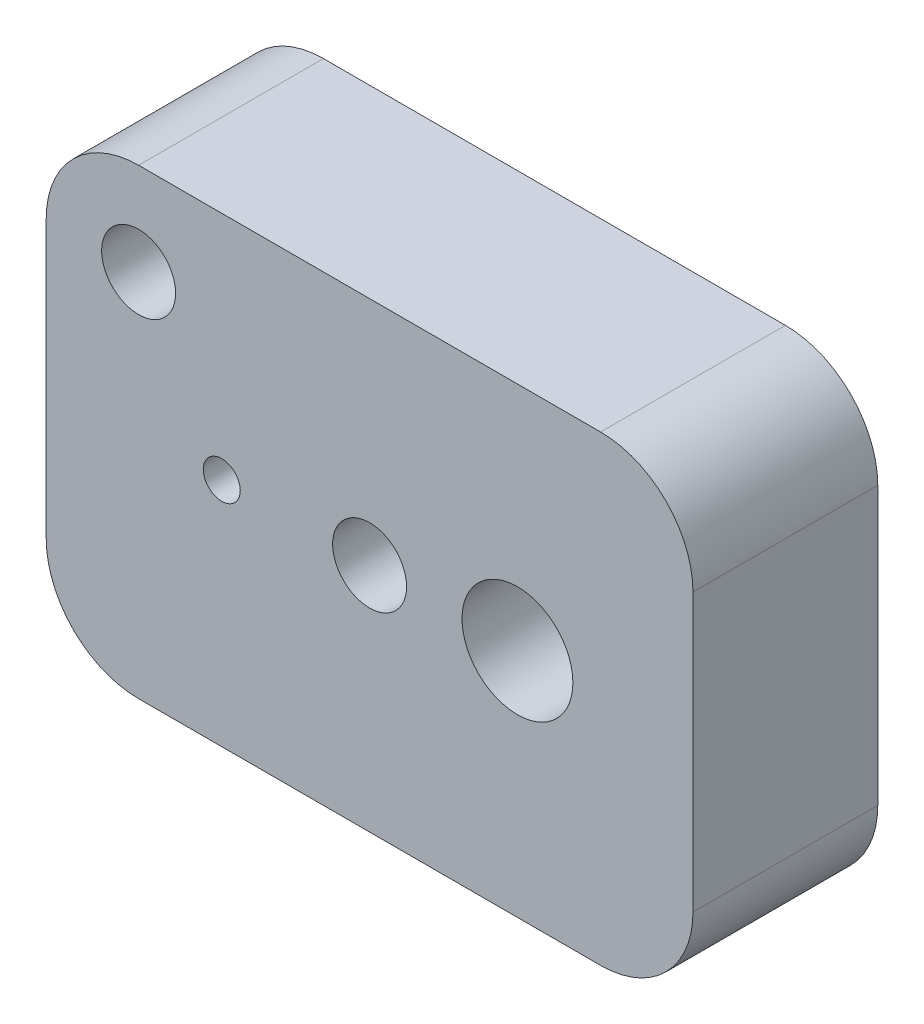
ISO-10303-21;
HEADER;
FILE_DESCRIPTION(('STEP AP214'),'2;1');
FILE_NAME('part.step','',(''),(''),'','','');
FILE_SCHEMA(('AUTOMOTIVE_DESIGN { 1 0 10303 214 1 1 1 1 }'));
ENDSEC;
DATA;
#1=APPLICATION_CONTEXT('core data for automotive mechanical design processes');
#2=APPLICATION_PROTOCOL_DEFINITION('international standard','automotive_design',2000,#1);
#3=PRODUCT_CONTEXT('',#1,'mechanical');
#4=PRODUCT('Part','Part','',(#3));
#5=PRODUCT_RELATED_PRODUCT_CATEGORY('part','',(#4));
#6=PRODUCT_DEFINITION_FORMATION('','',#4);
#7=PRODUCT_DEFINITION_CONTEXT('part definition',#1,'design');
#8=PRODUCT_DEFINITION('design','',#6,#7);
#9=PRODUCT_DEFINITION_SHAPE('','',#8);
#10=(LENGTH_UNIT() NAMED_UNIT(*) SI_UNIT(.MILLI.,.METRE.));
#11=(NAMED_UNIT(*) PLANE_ANGLE_UNIT() SI_UNIT($,.RADIAN.));
#12=(NAMED_UNIT(*) SI_UNIT($,.STERADIAN.) SOLID_ANGLE_UNIT());
#13=UNCERTAINTY_MEASURE_WITH_UNIT(LENGTH_MEASURE(1.E-05),#10,'distance_accuracy_value','');
#14=(GEOMETRIC_REPRESENTATION_CONTEXT(3) GLOBAL_UNCERTAINTY_ASSIGNED_CONTEXT((#13)) GLOBAL_UNIT_ASSIGNED_CONTEXT((#10,
#11,#12)) REPRESENTATION_CONTEXT('',''));
#15=CARTESIAN_POINT('',(0.,0.,0.));
#16=DIRECTION('',(0.,0.,1.));
#17=DIRECTION('',(1.,0.,0.));
#18=AXIS2_PLACEMENT_3D('',#15,#16,#17);
#19=CARTESIAN_POINT('',(17.5,12.5,0.));
#20=DIRECTION('',(0.,0.,1.));
#21=DIRECTION('',(1.,0.,0.));
#22=AXIS2_PLACEMENT_3D('',#19,#20,#21);
#23=PLANE('',#22);
#24=CARTESIAN_POINT('',(5.,20.,0.));
#25=DIRECTION('',(0.,0.,1.));
#26=DIRECTION('',(1.,0.,0.));
#27=AXIS2_PLACEMENT_3D('',#24,#25,#26);
#28=CIRCLE('',#27,2.);
#29=CARTESIAN_POINT('',(7.,20.,0.));
#30=VERTEX_POINT('',#29);
#31=EDGE_CURVE('E63',#30,#30,#28,.T.);
#32=ORIENTED_EDGE('',*,*,#31,.T.);
#33=EDGE_LOOP('',(#32));
#34=FACE_BOUND('',#33,.T.);
#35=ADVANCED_FACE('F52',(#34),#23,.T.);
#36=CARTESIAN_POINT('',(17.5,12.5,7.));
#37=DIRECTION('',(0.,0.,1.));
#38=DIRECTION('',(1.,0.,0.));
#39=AXIS2_PLACEMENT_3D('',#36,#37,#38);
#40=PLANE('',#39);
#41=CARTESIAN_POINT('',(5.,20.,7.));
#42=DIRECTION('',(0.,0.,1.));
#43=DIRECTION('',(1.,0.,0.));
#44=AXIS2_PLACEMENT_3D('',#41,#42,#43);
#45=CIRCLE('',#44,2.);
#46=CARTESIAN_POINT('',(7.,20.,7.));
#47=VERTEX_POINT('',#46);
#48=EDGE_CURVE('E12',#47,#47,#45,.T.);
#49=ORIENTED_EDGE('',*,*,#48,.F.);
#50=EDGE_LOOP('',(#49));
#51=FACE_BOUND('',#50,.T.);
#52=DIRECTION('',(1.,0.,0.));
#53=VECTOR('',#52,1.);
#54=CARTESIAN_POINT('',(17.5,25.,7.));
#55=LINE('',#54,#53);
#56=CARTESIAN_POINT('',(5.,25.,7.));
#57=VERTEX_POINT('',#56);
#58=CARTESIAN_POINT('',(30.,25.,7.));
#59=VERTEX_POINT('',#58);
#60=EDGE_CURVE('E194',#57,#59,#55,.T.);
#61=ORIENTED_EDGE('',*,*,#60,.F.);
#62=CARTESIAN_POINT('',(5.,20.,7.));
#63=DIRECTION('',(0.,0.,1.));
#64=DIRECTION('',(1.,0.,0.));
#65=AXIS2_PLACEMENT_3D('',#62,#63,#64);
#66=CIRCLE('',#65,5.);
#67=CARTESIAN_POINT('',(0.,20.,7.));
#68=VERTEX_POINT('',#67);
#69=EDGE_CURVE('E217',#57,#68,#66,.T.);
#70=ORIENTED_EDGE('',*,*,#69,.T.);
#71=DIRECTION('',(0.,1.,0.));
#72=VECTOR('',#71,1.);
#73=CARTESIAN_POINT('',(0.,12.5,7.));
#74=LINE('',#73,#72);
#75=CARTESIAN_POINT('',(0.,5.,7.));
#76=VERTEX_POINT('',#75);
#77=EDGE_CURVE('E203',#76,#68,#74,.T.);
#78=ORIENTED_EDGE('',*,*,#77,.F.);
#79=CARTESIAN_POINT('',(5.,5.,7.));
#80=DIRECTION('',(0.,0.,1.));
#81=DIRECTION('',(1.,0.,0.));
#82=AXIS2_PLACEMENT_3D('',#79,#80,#81);
#83=CIRCLE('',#82,5.);
#84=CARTESIAN_POINT('',(5.,0.,7.));
#85=VERTEX_POINT('',#84);
#86=EDGE_CURVE('E153',#76,#85,#83,.T.);
#87=ORIENTED_EDGE('',*,*,#86,.T.);
#88=DIRECTION('',(1.,0.,0.));
#89=VECTOR('',#88,1.);
#90=CARTESIAN_POINT('',(17.5,0.,7.));
#91=LINE('',#90,#89);
#92=CARTESIAN_POINT('',(30.,0.,7.));
#93=VERTEX_POINT('',#92);
#94=EDGE_CURVE('E148',#85,#93,#91,.T.);
#95=ORIENTED_EDGE('',*,*,#94,.T.);
#96=CARTESIAN_POINT('',(30.,5.,7.));
#97=DIRECTION('',(0.,0.,1.));
#98=DIRECTION('',(1.,0.,0.));
#99=AXIS2_PLACEMENT_3D('',#96,#97,#98);
#100=CIRCLE('',#99,5.);
#101=CARTESIAN_POINT('',(35.,5.,7.));
#102=VERTEX_POINT('',#101);
#103=EDGE_CURVE('E135',#93,#102,#100,.T.);
#104=ORIENTED_EDGE('',*,*,#103,.T.);
#105=DIRECTION('',(0.,1.,0.));
#106=VECTOR('',#105,1.);
#107=CARTESIAN_POINT('',(35.,12.5,7.));
#108=LINE('',#107,#106);
#109=CARTESIAN_POINT('',(35.,20.,7.));
#110=VERTEX_POINT('',#109);
#111=EDGE_CURVE('E186',#102,#110,#108,.T.);
#112=ORIENTED_EDGE('',*,*,#111,.T.);
#113=CARTESIAN_POINT('',(30.,20.,7.));
#114=DIRECTION('',(0.,0.,1.));
#115=DIRECTION('',(1.,0.,0.));
#116=AXIS2_PLACEMENT_3D('',#113,#114,#115);
#117=CIRCLE('',#116,5.);
#118=EDGE_CURVE('E75',#110,#59,#117,.T.);
#119=ORIENTED_EDGE('',*,*,#118,.T.);
#120=EDGE_LOOP('',(#61,#70,#78,#87,#95,#104,#112,#119));
#121=FACE_BOUND('',#120,.T.);
#122=CARTESIAN_POINT('',(17.5,12.5,7.));
#123=DIRECTION('',(0.,0.,1.));
#124=DIRECTION('',(1.,0.,0.));
#125=AXIS2_PLACEMENT_3D('',#122,#123,#124);
#126=CIRCLE('',#125,2.);
#127=CARTESIAN_POINT('',(19.5,12.5,7.));
#128=VERTEX_POINT('',#127);
#129=EDGE_CURVE('E218',#128,#128,#126,.T.);
#130=ORIENTED_EDGE('',*,*,#129,.F.);
#131=EDGE_LOOP('',(#130));
#132=FACE_BOUND('',#131,.T.);
#133=CARTESIAN_POINT('',(9.49999999999999,12.5,7.));
#134=DIRECTION('',(0.,0.,1.));
#135=DIRECTION('',(1.,0.,0.));
#136=AXIS2_PLACEMENT_3D('',#133,#134,#135);
#137=CIRCLE('',#136,1.);
#138=CARTESIAN_POINT('',(10.5,12.5,7.));
#139=VERTEX_POINT('',#138);
#140=EDGE_CURVE('E221',#139,#139,#137,.T.);
#141=ORIENTED_EDGE('',*,*,#140,.F.);
#142=EDGE_LOOP('',(#141));
#143=FACE_BOUND('',#142,.T.);
#144=CARTESIAN_POINT('',(25.5,12.5,7.));
#145=DIRECTION('',(0.,0.,1.));
#146=DIRECTION('',(1.,0.,0.));
#147=AXIS2_PLACEMENT_3D('',#144,#145,#146);
#148=CIRCLE('',#147,3.);
#149=CARTESIAN_POINT('',(28.5,12.5,7.));
#150=VERTEX_POINT('',#149);
#151=EDGE_CURVE('E56',#150,#150,#148,.T.);
#152=ORIENTED_EDGE('',*,*,#151,.F.);
#153=EDGE_LOOP('',(#152));
#154=FACE_BOUND('',#153,.T.);
#155=ADVANCED_FACE('F150',(#51,#121,#132,#143,#154),#40,.T.);
#156=CARTESIAN_POINT('',(5.,20.,7.));
#157=DIRECTION('',(0.,0.,-1.));
#158=DIRECTION('',(-1.,0.,0.));
#159=AXIS2_PLACEMENT_3D('',#156,#157,#158);
#160=CYLINDRICAL_SURFACE('',#159,2.);
#161=ORIENTED_EDGE('',*,*,#31,.F.);
#162=EDGE_LOOP('',(#161));
#163=FACE_BOUND('',#162,.T.);
#164=ORIENTED_EDGE('',*,*,#48,.T.);
#165=EDGE_LOOP('',(#164));
#166=FACE_BOUND('',#165,.T.);
#167=ADVANCED_FACE('F298',(#163,#166),#160,.F.);
#168=CARTESIAN_POINT('',(17.5,12.5,-3.));
#169=DIRECTION('',(0.,0.,1.));
#170=DIRECTION('',(1.,0.,0.));
#171=AXIS2_PLACEMENT_3D('',#168,#169,#170);
#172=PLANE('',#171);
#173=CARTESIAN_POINT('',(9.49999999999999,12.5,-3.));
#174=DIRECTION('',(0.,0.,1.));
#175=DIRECTION('',(1.,0.,0.));
#176=AXIS2_PLACEMENT_3D('',#173,#174,#175);
#177=CIRCLE('',#176,1.);
#178=CARTESIAN_POINT('',(10.5,12.5,-3.));
#179=VERTEX_POINT('',#178);
#180=EDGE_CURVE('E195',#179,#179,#177,.T.);
#181=ORIENTED_EDGE('',*,*,#180,.T.);
#182=EDGE_LOOP('',(#181));
#183=FACE_BOUND('',#182,.T.);
#184=CARTESIAN_POINT('',(17.5,12.5,-3.));
#185=DIRECTION('',(0.,0.,1.));
#186=DIRECTION('',(1.,0.,0.));
#187=AXIS2_PLACEMENT_3D('',#184,#185,#186);
#188=CIRCLE('',#187,2.);
#189=CARTESIAN_POINT('',(19.5,12.5,-3.));
#190=VERTEX_POINT('',#189);
#191=EDGE_CURVE('E222',#190,#190,#188,.T.);
#192=ORIENTED_EDGE('',*,*,#191,.T.);
#193=EDGE_LOOP('',(#192));
#194=FACE_BOUND('',#193,.T.);
#195=CARTESIAN_POINT('',(25.5,12.5,-3.));
#196=DIRECTION('',(0.,0.,1.));
#197=DIRECTION('',(1.,0.,0.));
#198=AXIS2_PLACEMENT_3D('',#195,#196,#197);
#199=CIRCLE('',#198,3.);
#200=CARTESIAN_POINT('',(28.5,12.5,-3.));
#201=VERTEX_POINT('',#200);
#202=EDGE_CURVE('E236',#201,#201,#199,.T.);
#203=ORIENTED_EDGE('',*,*,#202,.T.);
#204=EDGE_LOOP('',(#203));
#205=FACE_BOUND('',#204,.T.);
#206=DIRECTION('',(1.,0.,0.));
#207=VECTOR('',#206,1.);
#208=CARTESIAN_POINT('',(17.5,25.,-3.));
#209=LINE('',#208,#207);
#210=CARTESIAN_POINT('',(5.,25.,-3.));
#211=VERTEX_POINT('',#210);
#212=CARTESIAN_POINT('',(30.,25.,-3.));
#213=VERTEX_POINT('',#212);
#214=EDGE_CURVE('E199',#211,#213,#209,.T.);
#215=ORIENTED_EDGE('',*,*,#214,.T.);
#216=CARTESIAN_POINT('',(30.,20.,-3.));
#217=DIRECTION('',(0.,0.,1.));
#218=DIRECTION('',(1.,0.,0.));
#219=AXIS2_PLACEMENT_3D('',#216,#217,#218);
#220=CIRCLE('',#219,5.);
#221=CARTESIAN_POINT('',(35.,20.,-3.));
#222=VERTEX_POINT('',#221);
#223=EDGE_CURVE('E177',#222,#213,#220,.T.);
#224=ORIENTED_EDGE('',*,*,#223,.F.);
#225=DIRECTION('',(0.,1.,0.));
#226=VECTOR('',#225,1.);
#227=CARTESIAN_POINT('',(35.,12.5,-3.));
#228=LINE('',#227,#226);
#229=CARTESIAN_POINT('',(35.,5.,-3.));
#230=VERTEX_POINT('',#229);
#231=EDGE_CURVE('E210',#230,#222,#228,.T.);
#232=ORIENTED_EDGE('',*,*,#231,.F.);
#233=CARTESIAN_POINT('',(30.,5.,-3.));
#234=DIRECTION('',(0.,0.,1.));
#235=DIRECTION('',(1.,0.,0.));
#236=AXIS2_PLACEMENT_3D('',#233,#234,#235);
#237=CIRCLE('',#236,5.);
#238=CARTESIAN_POINT('',(30.,0.,-3.));
#239=VERTEX_POINT('',#238);
#240=EDGE_CURVE('E145',#239,#230,#237,.T.);
#241=ORIENTED_EDGE('',*,*,#240,.F.);
#242=DIRECTION('',(1.,0.,0.));
#243=VECTOR('',#242,1.);
#244=CARTESIAN_POINT('',(17.5,0.,-3.));
#245=LINE('',#244,#243);
#246=CARTESIAN_POINT('',(5.,0.,-3.));
#247=VERTEX_POINT('',#246);
#248=EDGE_CURVE('E158',#247,#239,#245,.T.);
#249=ORIENTED_EDGE('',*,*,#248,.F.);
#250=CARTESIAN_POINT('',(5.,5.,-3.));
#251=DIRECTION('',(0.,0.,1.));
#252=DIRECTION('',(1.,0.,0.));
#253=AXIS2_PLACEMENT_3D('',#250,#251,#252);
#254=CIRCLE('',#253,5.);
#255=CARTESIAN_POINT('',(0.,5.,-3.));
#256=VERTEX_POINT('',#255);
#257=EDGE_CURVE('E162',#256,#247,#254,.T.);
#258=ORIENTED_EDGE('',*,*,#257,.F.);
#259=DIRECTION('',(0.,1.,0.));
#260=VECTOR('',#259,1.);
#261=CARTESIAN_POINT('',(0.,12.5,-3.));
#262=LINE('',#261,#260);
#263=CARTESIAN_POINT('',(0.,20.,-3.));
#264=VERTEX_POINT('',#263);
#265=EDGE_CURVE('E183',#256,#264,#262,.T.);
#266=ORIENTED_EDGE('',*,*,#265,.T.);
#267=CARTESIAN_POINT('',(5.,20.,-3.));
#268=DIRECTION('',(0.,0.,1.));
#269=DIRECTION('',(1.,0.,0.));
#270=AXIS2_PLACEMENT_3D('',#267,#268,#269);
#271=CIRCLE('',#270,5.);
#272=EDGE_CURVE('E170',#211,#264,#271,.T.);
#273=ORIENTED_EDGE('',*,*,#272,.F.);
#274=EDGE_LOOP('',(#215,#224,#232,#241,#249,#258,#266,#273));
#275=FACE_BOUND('',#274,.T.);
#276=ADVANCED_FACE('F323',(#183,#194,#205,#275),#172,.F.);
#277=CARTESIAN_POINT('',(30.,20.,-3.));
#278=DIRECTION('',(0.,0.,1.));
#279=DIRECTION('',(1.,0.,0.));
#280=AXIS2_PLACEMENT_3D('',#277,#278,#279);
#281=CYLINDRICAL_SURFACE('',#280,5.);
#282=DIRECTION('',(0.,0.,1.));
#283=VECTOR('',#282,1.);
#284=CARTESIAN_POINT('',(30.,25.,-3.));
#285=LINE('',#284,#283);
#286=EDGE_CURVE('E196',#213,#59,#285,.T.);
#287=ORIENTED_EDGE('',*,*,#286,.T.);
#288=ORIENTED_EDGE('',*,*,#118,.F.);
#289=DIRECTION('',(0.,0.,1.));
#290=VECTOR('',#289,1.);
#291=CARTESIAN_POINT('',(35.,20.,-3.));
#292=LINE('',#291,#290);
#293=EDGE_CURVE('E174',#222,#110,#292,.T.);
#294=ORIENTED_EDGE('',*,*,#293,.F.);
#295=ORIENTED_EDGE('',*,*,#223,.T.);
#296=EDGE_LOOP('',(#287,#288,#294,#295));
#297=FACE_BOUND('',#296,.T.);
#298=ADVANCED_FACE('F316',(#297),#281,.T.);
#299=CARTESIAN_POINT('',(35.,12.5,-3.));
#300=DIRECTION('',(1.,0.,0.));
#301=DIRECTION('',(0.,1.,0.));
#302=AXIS2_PLACEMENT_3D('',#299,#300,#301);
#303=PLANE('',#302);
#304=ORIENTED_EDGE('',*,*,#293,.T.);
#305=ORIENTED_EDGE('',*,*,#111,.F.);
#306=DIRECTION('',(0.,0.,1.));
#307=VECTOR('',#306,1.);
#308=CARTESIAN_POINT('',(35.,5.,-3.));
#309=LINE('',#308,#307);
#310=EDGE_CURVE('E142',#230,#102,#309,.T.);
#311=ORIENTED_EDGE('',*,*,#310,.F.);
#312=ORIENTED_EDGE('',*,*,#231,.T.);
#313=EDGE_LOOP('',(#304,#305,#311,#312));
#314=FACE_BOUND('',#313,.T.);
#315=ADVANCED_FACE('F307',(#314),#303,.T.);
#316=CARTESIAN_POINT('',(30.,5.,-3.));
#317=DIRECTION('',(0.,0.,1.));
#318=DIRECTION('',(1.,0.,0.));
#319=AXIS2_PLACEMENT_3D('',#316,#317,#318);
#320=CYLINDRICAL_SURFACE('',#319,5.);
#321=ORIENTED_EDGE('',*,*,#310,.T.);
#322=ORIENTED_EDGE('',*,*,#103,.F.);
#323=DIRECTION('',(0.,0.,1.));
#324=VECTOR('',#323,1.);
#325=CARTESIAN_POINT('',(30.,0.,-3.));
#326=LINE('',#325,#324);
#327=EDGE_CURVE('E140',#239,#93,#326,.T.);
#328=ORIENTED_EDGE('',*,*,#327,.F.);
#329=ORIENTED_EDGE('',*,*,#240,.T.);
#330=EDGE_LOOP('',(#321,#322,#328,#329));
#331=FACE_BOUND('',#330,.T.);
#332=ADVANCED_FACE('F137',(#331),#320,.T.);
#333=CARTESIAN_POINT('',(17.5,0.,-3.));
#334=DIRECTION('',(0.,-1.,0.));
#335=DIRECTION('',(0.,0.,-1.));
#336=AXIS2_PLACEMENT_3D('',#333,#334,#335);
#337=PLANE('',#336);
#338=ORIENTED_EDGE('',*,*,#327,.T.);
#339=ORIENTED_EDGE('',*,*,#94,.F.);
#340=DIRECTION('',(0.,0.,1.));
#341=VECTOR('',#340,1.);
#342=CARTESIAN_POINT('',(5.,0.,-3.));
#343=LINE('',#342,#341);
#344=EDGE_CURVE('E180',#247,#85,#343,.T.);
#345=ORIENTED_EDGE('',*,*,#344,.F.);
#346=ORIENTED_EDGE('',*,*,#248,.T.);
#347=EDGE_LOOP('',(#338,#339,#345,#346));
#348=FACE_BOUND('',#347,.T.);
#349=ADVANCED_FACE('F54',(#348),#337,.T.);
#350=CARTESIAN_POINT('',(5.,5.,-3.));
#351=DIRECTION('',(0.,0.,1.));
#352=DIRECTION('',(1.,0.,0.));
#353=AXIS2_PLACEMENT_3D('',#350,#351,#352);
#354=CYLINDRICAL_SURFACE('',#353,5.);
#355=ORIENTED_EDGE('',*,*,#344,.T.);
#356=ORIENTED_EDGE('',*,*,#86,.F.);
#357=DIRECTION('',(0.,0.,1.));
#358=VECTOR('',#357,1.);
#359=CARTESIAN_POINT('',(0.,5.,-3.));
#360=LINE('',#359,#358);
#361=EDGE_CURVE('E207',#256,#76,#360,.T.);
#362=ORIENTED_EDGE('',*,*,#361,.F.);
#363=ORIENTED_EDGE('',*,*,#257,.T.);
#364=EDGE_LOOP('',(#355,#356,#362,#363));
#365=FACE_BOUND('',#364,.T.);
#366=ADVANCED_FACE('F278',(#365),#354,.T.);
#367=CARTESIAN_POINT('',(0.,12.5,-3.));
#368=DIRECTION('',(1.,0.,0.));
#369=DIRECTION('',(0.,1.,0.));
#370=AXIS2_PLACEMENT_3D('',#367,#368,#369);
#371=PLANE('',#370);
#372=ORIENTED_EDGE('',*,*,#361,.T.);
#373=ORIENTED_EDGE('',*,*,#77,.T.);
#374=DIRECTION('',(0.,0.,1.));
#375=VECTOR('',#374,1.);
#376=CARTESIAN_POINT('',(0.,20.,-3.));
#377=LINE('',#376,#375);
#378=EDGE_CURVE('E213',#264,#68,#377,.T.);
#379=ORIENTED_EDGE('',*,*,#378,.F.);
#380=ORIENTED_EDGE('',*,*,#265,.F.);
#381=EDGE_LOOP('',(#372,#373,#379,#380));
#382=FACE_BOUND('',#381,.T.);
#383=ADVANCED_FACE('F269',(#382),#371,.F.);
#384=CARTESIAN_POINT('',(5.,20.,-3.));
#385=DIRECTION('',(0.,0.,1.));
#386=DIRECTION('',(1.,0.,0.));
#387=AXIS2_PLACEMENT_3D('',#384,#385,#386);
#388=CYLINDRICAL_SURFACE('',#387,5.);
#389=ORIENTED_EDGE('',*,*,#378,.T.);
#390=ORIENTED_EDGE('',*,*,#69,.F.);
#391=DIRECTION('',(0.,0.,1.));
#392=VECTOR('',#391,1.);
#393=CARTESIAN_POINT('',(5.,25.,-3.));
#394=LINE('',#393,#392);
#395=EDGE_CURVE('E190',#211,#57,#394,.T.);
#396=ORIENTED_EDGE('',*,*,#395,.F.);
#397=ORIENTED_EDGE('',*,*,#272,.T.);
#398=EDGE_LOOP('',(#389,#390,#396,#397));
#399=FACE_BOUND('',#398,.T.);
#400=ADVANCED_FACE('F264',(#399),#388,.T.);
#401=CARTESIAN_POINT('',(17.5,25.,-3.));
#402=DIRECTION('',(0.,-1.,0.));
#403=DIRECTION('',(0.,0.,-1.));
#404=AXIS2_PLACEMENT_3D('',#401,#402,#403);
#405=PLANE('',#404);
#406=ORIENTED_EDGE('',*,*,#395,.T.);
#407=ORIENTED_EDGE('',*,*,#60,.T.);
#408=ORIENTED_EDGE('',*,*,#286,.F.);
#409=ORIENTED_EDGE('',*,*,#214,.F.);
#410=EDGE_LOOP('',(#406,#407,#408,#409));
#411=FACE_BOUND('',#410,.T.);
#412=ADVANCED_FACE('F284',(#411),#405,.F.);
#413=CARTESIAN_POINT('',(25.5,12.5,-3.));
#414=DIRECTION('',(0.,0.,1.));
#415=DIRECTION('',(1.,0.,0.));
#416=AXIS2_PLACEMENT_3D('',#413,#414,#415);
#417=CYLINDRICAL_SURFACE('',#416,3.);
#418=ORIENTED_EDGE('',*,*,#202,.F.);
#419=EDGE_LOOP('',(#418));
#420=FACE_BOUND('',#419,.T.);
#421=ORIENTED_EDGE('',*,*,#151,.T.);
#422=EDGE_LOOP('',(#421));
#423=FACE_BOUND('',#422,.T.);
#424=ADVANCED_FACE('F288',(#420,#423),#417,.F.);
#425=CARTESIAN_POINT('',(17.5,12.5,-3.));
#426=DIRECTION('',(0.,0.,1.));
#427=DIRECTION('',(1.,0.,0.));
#428=AXIS2_PLACEMENT_3D('',#425,#426,#427);
#429=CYLINDRICAL_SURFACE('',#428,2.);
#430=ORIENTED_EDGE('',*,*,#191,.F.);
#431=EDGE_LOOP('',(#430));
#432=FACE_BOUND('',#431,.T.);
#433=ORIENTED_EDGE('',*,*,#129,.T.);
#434=EDGE_LOOP('',(#433));
#435=FACE_BOUND('',#434,.T.);
#436=ADVANCED_FACE('F492',(#432,#435),#429,.F.);
#437=CARTESIAN_POINT('',(9.49999999999999,12.5,-3.));
#438=DIRECTION('',(0.,0.,1.));
#439=DIRECTION('',(1.,0.,0.));
#440=AXIS2_PLACEMENT_3D('',#437,#438,#439);
#441=CYLINDRICAL_SURFACE('',#440,1.);
#442=ORIENTED_EDGE('',*,*,#180,.F.);
#443=EDGE_LOOP('',(#442));
#444=FACE_BOUND('',#443,.T.);
#445=ORIENTED_EDGE('',*,*,#140,.T.);
#446=EDGE_LOOP('',(#445));
#447=FACE_BOUND('',#446,.T.);
#448=ADVANCED_FACE('F500',(#444,#447),#441,.F.);
#449=CLOSED_SHELL('',(#35,#155,#167,#276,#298,#315,#332,#349,#366,#383,#400,#412,#424,#436,#448));
#450=MANIFOLD_SOLID_BREP('B2',#449);
#451=ADVANCED_BREP_SHAPE_REPRESENTATION('',(#18,#450),#14);
#452=SHAPE_DEFINITION_REPRESENTATION(#9,#451);
ENDSEC;
END-ISO-10303-21;
